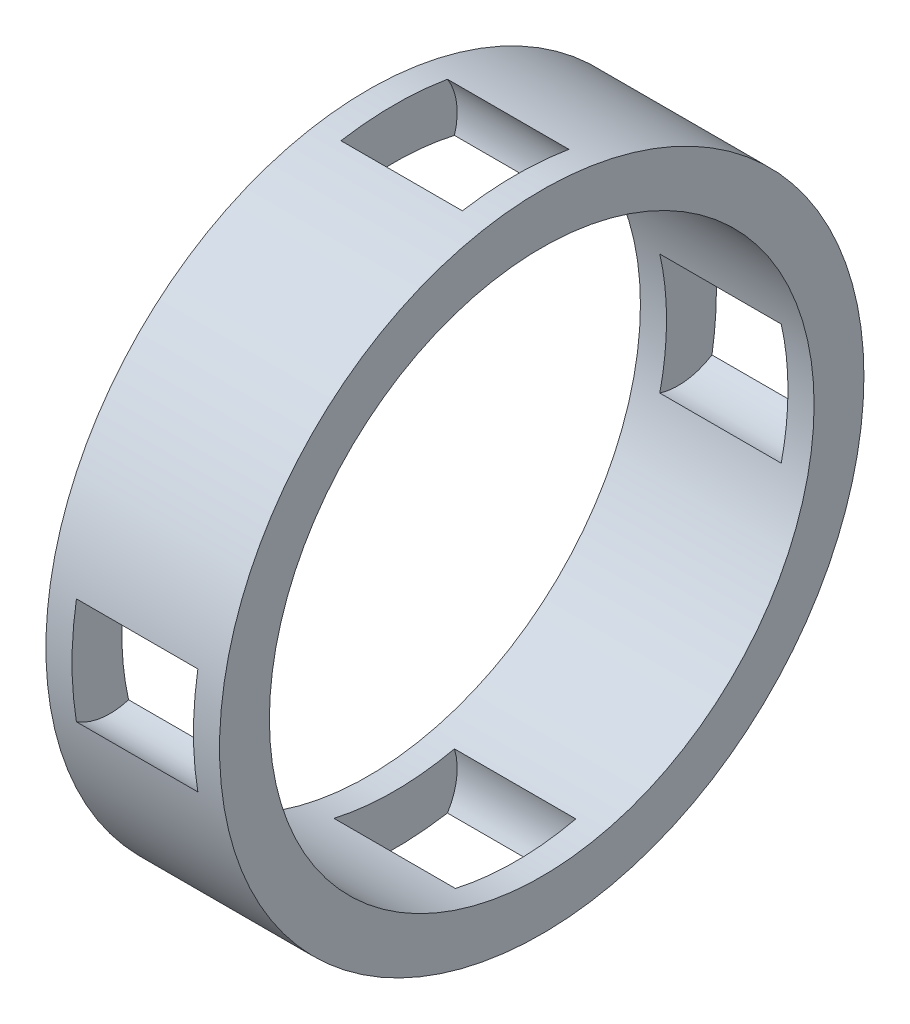
ISO-10303-21;
HEADER;
FILE_DESCRIPTION(('STEP AP214'),'2;1');
FILE_NAME('part.step','',(''),(''),'','','');
FILE_SCHEMA(('AUTOMOTIVE_DESIGN { 1 0 10303 214 1 1 1 1 }'));
ENDSEC;
DATA;
#1=APPLICATION_CONTEXT('core data for automotive mechanical design processes');
#2=APPLICATION_PROTOCOL_DEFINITION('international standard','automotive_design',2000,#1);
#3=PRODUCT_CONTEXT('',#1,'mechanical');
#4=PRODUCT('Part','Part','',(#3));
#5=PRODUCT_RELATED_PRODUCT_CATEGORY('part','',(#4));
#6=PRODUCT_DEFINITION_FORMATION('','',#4);
#7=PRODUCT_DEFINITION_CONTEXT('part definition',#1,'design');
#8=PRODUCT_DEFINITION('design','',#6,#7);
#9=PRODUCT_DEFINITION_SHAPE('','',#8);
#10=(LENGTH_UNIT() NAMED_UNIT(*) SI_UNIT(.MILLI.,.METRE.));
#11=(NAMED_UNIT(*) PLANE_ANGLE_UNIT() SI_UNIT($,.RADIAN.));
#12=(NAMED_UNIT(*) SI_UNIT($,.STERADIAN.) SOLID_ANGLE_UNIT());
#13=UNCERTAINTY_MEASURE_WITH_UNIT(LENGTH_MEASURE(1.E-05),#10,'distance_accuracy_value','');
#14=(GEOMETRIC_REPRESENTATION_CONTEXT(3) GLOBAL_UNCERTAINTY_ASSIGNED_CONTEXT((#13)) GLOBAL_UNIT_ASSIGNED_CONTEXT((#10,
#11,#12)) REPRESENTATION_CONTEXT('',''));
#15=CARTESIAN_POINT('',(0.,0.,0.));
#16=DIRECTION('',(0.,0.,1.));
#17=DIRECTION('',(1.,0.,0.));
#18=AXIS2_PLACEMENT_3D('',#15,#16,#17);
#19=CARTESIAN_POINT('',(2.85,12.4,0.));
#20=DIRECTION('',(-1.,0.,0.));
#21=DIRECTION('',(0.,0.,1.));
#22=AXIS2_PLACEMENT_3D('',#19,#20,#21);
#23=PLANE('',#22);
#24=CARTESIAN_POINT('',(2.85,12.4,0.));
#25=DIRECTION('',(1.,0.,0.));
#26=DIRECTION('',(0.,0.,-1.));
#27=AXIS2_PLACEMENT_3D('',#24,#25,#26);
#28=CIRCLE('',#27,2.75);
#29=CARTESIAN_POINT('',(2.85,11.5931514616935,-2.6289723156079));
#30=VERTEX_POINT('',#29);
#31=CARTESIAN_POINT('',(2.85,13.8690083165323,-2.32476118471534));
#32=VERTEX_POINT('',#31);
#33=EDGE_CURVE('E19',#30,#32,#28,.T.);
#34=ORIENTED_EDGE('',*,*,#33,.T.);
#35=CARTESIAN_POINT('',(2.85,0.,0.));
#36=DIRECTION('',(1.,0.,0.));
#37=DIRECTION('',(0.,0.,-1.));
#38=AXIS2_PLACEMENT_3D('',#35,#36,#37);
#39=CIRCLE('',#38,14.0625);
#40=CARTESIAN_POINT('',(2.85,13.8690083165323,2.32476118471534));
#41=VERTEX_POINT('',#40);
#42=EDGE_CURVE('E160',#41,#32,#39,.F.);
#43=ORIENTED_EDGE('',*,*,#42,.F.);
#44=CARTESIAN_POINT('',(2.85,12.4,0.));
#45=DIRECTION('',(1.,0.,0.));
#46=DIRECTION('',(0.,0.,-1.));
#47=AXIS2_PLACEMENT_3D('',#44,#45,#46);
#48=CIRCLE('',#47,2.75);
#49=CARTESIAN_POINT('',(2.85,11.5931514616935,2.62897231560789));
#50=VERTEX_POINT('',#49);
#51=EDGE_CURVE('E129',#41,#50,#48,.T.);
#52=ORIENTED_EDGE('',*,*,#51,.T.);
#53=CARTESIAN_POINT('',(2.85,0.,0.));
#54=DIRECTION('',(1.,0.,0.));
#55=DIRECTION('',(0.,0.,-1.));
#56=AXIS2_PLACEMENT_3D('',#53,#54,#55);
#57=CIRCLE('',#56,11.8875);
#58=EDGE_CURVE('E125',#50,#30,#57,.F.);
#59=ORIENTED_EDGE('',*,*,#58,.T.);
#60=EDGE_LOOP('',(#34,#43,#52,#59));
#61=FACE_BOUND('',#60,.T.);
#62=ADVANCED_FACE('F16',(#61),#23,.F.);
#63=CARTESIAN_POINT('',(5.5,12.4,0.));
#64=DIRECTION('',(1.,0.,0.));
#65=DIRECTION('',(0.,0.,-1.));
#66=AXIS2_PLACEMENT_3D('',#63,#64,#65);
#67=CYLINDRICAL_SURFACE('',#66,2.75);
#68=CARTESIAN_POINT('',(8.15,12.4,0.));
#69=DIRECTION('',(1.,0.,0.));
#70=DIRECTION('',(0.,0.,-1.));
#71=AXIS2_PLACEMENT_3D('',#68,#69,#70);
#72=CIRCLE('',#71,2.75);
#73=CARTESIAN_POINT('',(8.15,11.5931514616935,-2.62897231560789));
#74=VERTEX_POINT('',#73);
#75=CARTESIAN_POINT('',(8.15,13.8690083165323,-2.32476118471534));
#76=VERTEX_POINT('',#75);
#77=EDGE_CURVE('E143',#74,#76,#72,.T.);
#78=ORIENTED_EDGE('',*,*,#77,.T.);
#79=DIRECTION('',(1.,0.,0.));
#80=VECTOR('',#79,1.);
#81=CARTESIAN_POINT('',(5.5,13.8690083165323,-2.32476118471534));
#82=LINE('',#81,#80);
#83=EDGE_CURVE('E141',#32,#76,#82,.T.);
#84=ORIENTED_EDGE('',*,*,#83,.F.);
#85=ORIENTED_EDGE('',*,*,#33,.F.);
#86=DIRECTION('',(1.,0.,0.));
#87=VECTOR('',#86,1.);
#88=CARTESIAN_POINT('',(5.5,11.5931514616935,-2.62897231560789));
#89=LINE('',#88,#87);
#90=EDGE_CURVE('E134',#30,#74,#89,.T.);
#91=ORIENTED_EDGE('',*,*,#90,.T.);
#92=EDGE_LOOP('',(#78,#84,#85,#91));
#93=FACE_BOUND('',#92,.T.);
#94=ADVANCED_FACE('F138',(#93),#67,.F.);
#95=CARTESIAN_POINT('',(8.15,12.4,0.));
#96=DIRECTION('',(1.,0.,0.));
#97=DIRECTION('',(0.,1.,0.));
#98=AXIS2_PLACEMENT_3D('',#95,#96,#97);
#99=PLANE('',#98);
#100=CARTESIAN_POINT('',(8.15,12.4,0.));
#101=DIRECTION('',(1.,0.,0.));
#102=DIRECTION('',(0.,0.,-1.));
#103=AXIS2_PLACEMENT_3D('',#100,#101,#102);
#104=CIRCLE('',#103,2.75);
#105=CARTESIAN_POINT('',(8.15,11.5931514616935,2.6289723156079));
#106=VERTEX_POINT('',#105);
#107=CARTESIAN_POINT('',(8.15,13.8690083165323,2.32476118471534));
#108=VERTEX_POINT('',#107);
#109=EDGE_CURVE('E241',#106,#108,#104,.F.);
#110=ORIENTED_EDGE('',*,*,#109,.T.);
#111=CARTESIAN_POINT('',(8.15,0.,0.));
#112=DIRECTION('',(1.,0.,0.));
#113=DIRECTION('',(0.,0.,-1.));
#114=AXIS2_PLACEMENT_3D('',#111,#112,#113);
#115=CIRCLE('',#114,14.0625);
#116=EDGE_CURVE('E161',#76,#108,#115,.T.);
#117=ORIENTED_EDGE('',*,*,#116,.F.);
#118=ORIENTED_EDGE('',*,*,#77,.F.);
#119=CARTESIAN_POINT('',(8.15,0.,0.));
#120=DIRECTION('',(1.,0.,0.));
#121=DIRECTION('',(0.,0.,-1.));
#122=AXIS2_PLACEMENT_3D('',#119,#120,#121);
#123=CIRCLE('',#122,11.8875);
#124=EDGE_CURVE('E147',#74,#106,#123,.T.);
#125=ORIENTED_EDGE('',*,*,#124,.T.);
#126=EDGE_LOOP('',(#110,#117,#118,#125));
#127=FACE_BOUND('',#126,.T.);
#128=ADVANCED_FACE('F244',(#127),#99,.F.);
#129=CARTESIAN_POINT('',(5.5,12.4,0.));
#130=DIRECTION('',(1.,0.,0.));
#131=DIRECTION('',(0.,0.,-1.));
#132=AXIS2_PLACEMENT_3D('',#129,#130,#131);
#133=CYLINDRICAL_SURFACE('',#132,2.75);
#134=ORIENTED_EDGE('',*,*,#51,.F.);
#135=DIRECTION('',(1.,0.,0.));
#136=VECTOR('',#135,1.);
#137=CARTESIAN_POINT('',(5.5,13.8690083165323,2.32476118471534));
#138=LINE('',#137,#136);
#139=EDGE_CURVE('E157',#108,#41,#138,.F.);
#140=ORIENTED_EDGE('',*,*,#139,.F.);
#141=ORIENTED_EDGE('',*,*,#109,.F.);
#142=DIRECTION('',(1.,0.,0.));
#143=VECTOR('',#142,1.);
#144=CARTESIAN_POINT('',(5.5,11.5931514616935,2.62897231560789));
#145=LINE('',#144,#143);
#146=EDGE_CURVE('E149',#106,#50,#145,.F.);
#147=ORIENTED_EDGE('',*,*,#146,.T.);
#148=EDGE_LOOP('',(#134,#140,#141,#147));
#149=FACE_BOUND('',#148,.T.);
#150=ADVANCED_FACE('F250',(#149),#133,.F.);
#151=CARTESIAN_POINT('',(5.5,0.,-12.4));
#152=DIRECTION('',(1.,0.,0.));
#153=DIRECTION('',(0.,0.,-1.));
#154=AXIS2_PLACEMENT_3D('',#151,#152,#153);
#155=CYLINDRICAL_SURFACE('',#154,2.75);
#156=CARTESIAN_POINT('',(2.85,0.,-12.4));
#157=DIRECTION('',(1.,0.,0.));
#158=DIRECTION('',(0.,0.,-1.));
#159=AXIS2_PLACEMENT_3D('',#156,#157,#158);
#160=CIRCLE('',#159,2.75);
#161=CARTESIAN_POINT('',(2.85,2.6289723156079,-11.5931514616935));
#162=VERTEX_POINT('',#161);
#163=CARTESIAN_POINT('',(2.85,2.32476118471534,-13.8690083165323));
#164=VERTEX_POINT('',#163);
#165=EDGE_CURVE('E215',#162,#164,#160,.F.);
#166=ORIENTED_EDGE('',*,*,#165,.T.);
#167=DIRECTION('',(1.,0.,0.));
#168=VECTOR('',#167,1.);
#169=CARTESIAN_POINT('',(5.5,2.32476118471534,-13.8690083165323));
#170=LINE('',#169,#168);
#171=CARTESIAN_POINT('',(8.15,2.32476118471534,-13.8690083165323));
#172=VERTEX_POINT('',#171);
#173=EDGE_CURVE('E162',#172,#164,#170,.F.);
#174=ORIENTED_EDGE('',*,*,#173,.F.);
#175=CARTESIAN_POINT('',(8.15,0.,-12.4));
#176=DIRECTION('',(1.,0.,0.));
#177=DIRECTION('',(0.,0.,-1.));
#178=AXIS2_PLACEMENT_3D('',#175,#176,#177);
#179=CIRCLE('',#178,2.75);
#180=CARTESIAN_POINT('',(8.15,2.62897231560789,-11.5931514616935));
#181=VERTEX_POINT('',#180);
#182=EDGE_CURVE('E206',#172,#181,#179,.T.);
#183=ORIENTED_EDGE('',*,*,#182,.T.);
#184=DIRECTION('',(1.,0.,0.));
#185=VECTOR('',#184,1.);
#186=CARTESIAN_POINT('',(5.5,2.62897231560789,-11.5931514616935));
#187=LINE('',#186,#185);
#188=EDGE_CURVE('E333',#181,#162,#187,.F.);
#189=ORIENTED_EDGE('',*,*,#188,.T.);
#190=EDGE_LOOP('',(#166,#174,#183,#189));
#191=FACE_BOUND('',#190,.T.);
#192=ADVANCED_FACE('F252',(#191),#155,.F.);
#193=CARTESIAN_POINT('',(5.5,0.,12.4));
#194=DIRECTION('',(1.,0.,0.));
#195=DIRECTION('',(0.,0.,-1.));
#196=AXIS2_PLACEMENT_3D('',#193,#194,#195);
#197=CYLINDRICAL_SURFACE('',#196,2.75);
#198=CARTESIAN_POINT('',(8.15,0.,12.4));
#199=DIRECTION('',(1.,0.,0.));
#200=DIRECTION('',(0.,0.,-1.));
#201=AXIS2_PLACEMENT_3D('',#198,#199,#200);
#202=CIRCLE('',#201,2.75);
#203=CARTESIAN_POINT('',(8.15,2.6289723156079,11.5931514616935));
#204=VERTEX_POINT('',#203);
#205=CARTESIAN_POINT('',(8.15,2.32476118471534,13.8690083165323));
#206=VERTEX_POINT('',#205);
#207=EDGE_CURVE('E198',#204,#206,#202,.T.);
#208=ORIENTED_EDGE('',*,*,#207,.T.);
#209=DIRECTION('',(1.,0.,0.));
#210=VECTOR('',#209,1.);
#211=CARTESIAN_POINT('',(5.5,2.32476118471534,13.8690083165323));
#212=LINE('',#211,#210);
#213=CARTESIAN_POINT('',(2.85,2.32476118471534,13.8690083165323));
#214=VERTEX_POINT('',#213);
#215=EDGE_CURVE('E237',#214,#206,#212,.T.);
#216=ORIENTED_EDGE('',*,*,#215,.F.);
#217=CARTESIAN_POINT('',(2.85,0.,12.4));
#218=DIRECTION('',(1.,0.,0.));
#219=DIRECTION('',(0.,0.,-1.));
#220=AXIS2_PLACEMENT_3D('',#217,#218,#219);
#221=CIRCLE('',#220,2.75);
#222=CARTESIAN_POINT('',(2.85,2.6289723156079,11.5931514616935));
#223=VERTEX_POINT('',#222);
#224=EDGE_CURVE('E189',#214,#223,#221,.F.);
#225=ORIENTED_EDGE('',*,*,#224,.T.);
#226=DIRECTION('',(1.,0.,0.));
#227=VECTOR('',#226,1.);
#228=CARTESIAN_POINT('',(5.5,2.6289723156079,11.5931514616935));
#229=LINE('',#228,#227);
#230=EDGE_CURVE('E135',#223,#204,#229,.T.);
#231=ORIENTED_EDGE('',*,*,#230,.T.);
#232=EDGE_LOOP('',(#208,#216,#225,#231));
#233=FACE_BOUND('',#232,.T.);
#234=ADVANCED_FACE('F259',(#233),#197,.F.);
#235=CARTESIAN_POINT('',(5.5,0.,0.));
#236=DIRECTION('',(1.,0.,0.));
#237=DIRECTION('',(0.,0.,-1.));
#238=AXIS2_PLACEMENT_3D('',#235,#236,#237);
#239=CYLINDRICAL_SURFACE('',#238,11.8875);
#240=CARTESIAN_POINT('',(8.14999999999999,0.,0.));
#241=DIRECTION('',(1.,0.,0.));
#242=DIRECTION('',(0.,0.,-1.));
#243=AXIS2_PLACEMENT_3D('',#240,#241,#242);
#244=CIRCLE('',#243,11.8875);
#245=CARTESIAN_POINT('',(8.15,-2.6289723156079,-11.5931514616935));
#246=VERTEX_POINT('',#245);
#247=EDGE_CURVE('E204',#181,#246,#244,.F.);
#248=ORIENTED_EDGE('',*,*,#247,.T.);
#249=DIRECTION('',(1.,0.,0.));
#250=VECTOR('',#249,1.);
#251=CARTESIAN_POINT('',(5.5,-2.62897231560789,-11.5931514616935));
#252=LINE('',#251,#250);
#253=CARTESIAN_POINT('',(2.85,-2.6289723156079,-11.5931514616935));
#254=VERTEX_POINT('',#253);
#255=EDGE_CURVE('E210',#246,#254,#252,.F.);
#256=ORIENTED_EDGE('',*,*,#255,.T.);
#257=CARTESIAN_POINT('',(2.84999999999999,0.,0.));
#258=DIRECTION('',(1.,0.,0.));
#259=DIRECTION('',(0.,0.,-1.));
#260=AXIS2_PLACEMENT_3D('',#257,#258,#259);
#261=CIRCLE('',#260,11.8875);
#262=EDGE_CURVE('E213',#254,#162,#261,.T.);
#263=ORIENTED_EDGE('',*,*,#262,.T.);
#264=ORIENTED_EDGE('',*,*,#188,.F.);
#265=EDGE_LOOP('',(#248,#256,#263,#264));
#266=FACE_BOUND('',#265,.T.);
#267=CARTESIAN_POINT('',(1.71,0.,0.));
#268=DIRECTION('',(1.,0.,0.));
#269=DIRECTION('',(0.,0.,-1.));
#270=AXIS2_PLACEMENT_3D('',#267,#268,#269);
#271=CIRCLE('',#270,11.8875);
#272=CARTESIAN_POINT('',(1.71,0.,-11.8875));
#273=VERTEX_POINT('',#272);
#274=EDGE_CURVE('E218',#273,#273,#271,.T.);
#275=ORIENTED_EDGE('',*,*,#274,.F.);
#276=EDGE_LOOP('',(#275));
#277=FACE_BOUND('',#276,.T.);
#278=CARTESIAN_POINT('',(2.85,0.,0.));
#279=DIRECTION('',(1.,0.,0.));
#280=DIRECTION('',(0.,0.,-1.));
#281=AXIS2_PLACEMENT_3D('',#278,#279,#280);
#282=CIRCLE('',#281,11.8875);
#283=CARTESIAN_POINT('',(2.85,-2.6289723156079,11.5931514616935));
#284=VERTEX_POINT('',#283);
#285=EDGE_CURVE('E187',#223,#284,#282,.T.);
#286=ORIENTED_EDGE('',*,*,#285,.T.);
#287=DIRECTION('',(1.,0.,0.));
#288=VECTOR('',#287,1.);
#289=CARTESIAN_POINT('',(5.5,-2.6289723156079,11.5931514616935));
#290=LINE('',#289,#288);
#291=CARTESIAN_POINT('',(8.15,-2.6289723156079,11.5931514616935));
#292=VERTEX_POINT('',#291);
#293=EDGE_CURVE('E193',#284,#292,#290,.T.);
#294=ORIENTED_EDGE('',*,*,#293,.T.);
#295=CARTESIAN_POINT('',(8.15,0.,0.));
#296=DIRECTION('',(1.,0.,0.));
#297=DIRECTION('',(0.,0.,-1.));
#298=AXIS2_PLACEMENT_3D('',#295,#296,#297);
#299=CIRCLE('',#298,11.8875);
#300=EDGE_CURVE('E196',#292,#204,#299,.F.);
#301=ORIENTED_EDGE('',*,*,#300,.T.);
#302=ORIENTED_EDGE('',*,*,#230,.F.);
#303=EDGE_LOOP('',(#286,#294,#301,#302));
#304=FACE_BOUND('',#303,.T.);
#305=ORIENTED_EDGE('',*,*,#124,.F.);
#306=ORIENTED_EDGE('',*,*,#90,.F.);
#307=ORIENTED_EDGE('',*,*,#58,.F.);
#308=ORIENTED_EDGE('',*,*,#146,.F.);
#309=EDGE_LOOP('',(#305,#306,#307,#308));
#310=FACE_BOUND('',#309,.T.);
#311=CARTESIAN_POINT('',(9.29,0.,0.));
#312=DIRECTION('',(1.,0.,0.));
#313=DIRECTION('',(0.,0.,-1.));
#314=AXIS2_PLACEMENT_3D('',#311,#312,#313);
#315=CIRCLE('',#314,11.8875);
#316=CARTESIAN_POINT('',(9.29,0.,-11.8875));
#317=VERTEX_POINT('',#316);
#318=EDGE_CURVE('E201',#317,#317,#315,.F.);
#319=ORIENTED_EDGE('',*,*,#318,.F.);
#320=EDGE_LOOP('',(#319));
#321=FACE_BOUND('',#320,.T.);
#322=CARTESIAN_POINT('',(8.15,0.,0.));
#323=DIRECTION('',(1.,0.,0.));
#324=DIRECTION('',(0.,0.,-1.));
#325=AXIS2_PLACEMENT_3D('',#322,#323,#324);
#326=CIRCLE('',#325,11.8875);
#327=CARTESIAN_POINT('',(8.15,-11.5931514616935,-2.62897231560789));
#328=VERTEX_POINT('',#327);
#329=CARTESIAN_POINT('',(8.15,-11.5931514616935,2.6289723156079));
#330=VERTEX_POINT('',#329);
#331=EDGE_CURVE('E231',#328,#330,#326,.F.);
#332=ORIENTED_EDGE('',*,*,#331,.T.);
#333=DIRECTION('',(1.,0.,0.));
#334=VECTOR('',#333,1.);
#335=CARTESIAN_POINT('',(5.5,-11.5931514616935,2.6289723156079));
#336=LINE('',#335,#334);
#337=CARTESIAN_POINT('',(2.85,-11.5931514616935,2.6289723156079));
#338=VERTEX_POINT('',#337);
#339=EDGE_CURVE('E156',#330,#338,#336,.F.);
#340=ORIENTED_EDGE('',*,*,#339,.T.);
#341=CARTESIAN_POINT('',(2.85,0.,0.));
#342=DIRECTION('',(1.,0.,0.));
#343=DIRECTION('',(0.,0.,-1.));
#344=AXIS2_PLACEMENT_3D('',#341,#342,#343);
#345=CIRCLE('',#344,11.8875);
#346=CARTESIAN_POINT('',(2.85,-11.5931514616935,-2.6289723156079));
#347=VERTEX_POINT('',#346);
#348=EDGE_CURVE('E221',#338,#347,#345,.T.);
#349=ORIENTED_EDGE('',*,*,#348,.T.);
#350=DIRECTION('',(1.,0.,0.));
#351=VECTOR('',#350,1.);
#352=CARTESIAN_POINT('',(5.5,-11.5931514616935,-2.62897231560789));
#353=LINE('',#352,#351);
#354=EDGE_CURVE('E153',#347,#328,#353,.T.);
#355=ORIENTED_EDGE('',*,*,#354,.T.);
#356=EDGE_LOOP('',(#332,#340,#349,#355));
#357=FACE_BOUND('',#356,.T.);
#358=ADVANCED_FACE('F145',(#266,#277,#304,#310,#321,#357),#239,.F.);
#359=CARTESIAN_POINT('',(5.5,-12.4,0.));
#360=DIRECTION('',(1.,0.,0.));
#361=DIRECTION('',(0.,0.,-1.));
#362=AXIS2_PLACEMENT_3D('',#359,#360,#361);
#363=CYLINDRICAL_SURFACE('',#362,2.75);
#364=CARTESIAN_POINT('',(8.15,-12.4,0.));
#365=DIRECTION('',(1.,0.,0.));
#366=DIRECTION('',(0.,0.,-1.));
#367=AXIS2_PLACEMENT_3D('',#364,#365,#366);
#368=CIRCLE('',#367,2.75);
#369=CARTESIAN_POINT('',(8.15,-13.8690083165323,2.32476118471534));
#370=VERTEX_POINT('',#369);
#371=EDGE_CURVE('E234',#330,#370,#368,.T.);
#372=ORIENTED_EDGE('',*,*,#371,.T.);
#373=DIRECTION('',(1.,0.,0.));
#374=VECTOR('',#373,1.);
#375=CARTESIAN_POINT('',(5.5,-13.8690083165323,2.32476118471534));
#376=LINE('',#375,#374);
#377=CARTESIAN_POINT('',(2.85,-13.8690083165323,2.32476118471534));
#378=VERTEX_POINT('',#377);
#379=EDGE_CURVE('E186',#378,#370,#376,.T.);
#380=ORIENTED_EDGE('',*,*,#379,.F.);
#381=CARTESIAN_POINT('',(2.85,-12.4,0.));
#382=DIRECTION('',(1.,0.,0.));
#383=DIRECTION('',(0.,0.,-1.));
#384=AXIS2_PLACEMENT_3D('',#381,#382,#383);
#385=CIRCLE('',#384,2.75);
#386=EDGE_CURVE('E224',#378,#338,#385,.F.);
#387=ORIENTED_EDGE('',*,*,#386,.T.);
#388=ORIENTED_EDGE('',*,*,#339,.F.);
#389=EDGE_LOOP('',(#372,#380,#387,#388));
#390=FACE_BOUND('',#389,.T.);
#391=ADVANCED_FACE('F312',(#390),#363,.F.);
#392=CARTESIAN_POINT('',(8.15,-12.4,0.));
#393=DIRECTION('',(1.,0.,0.));
#394=DIRECTION('',(0.,1.,0.));
#395=AXIS2_PLACEMENT_3D('',#392,#393,#394);
#396=PLANE('',#395);
#397=CARTESIAN_POINT('',(8.15,-12.4,0.));
#398=DIRECTION('',(1.,0.,0.));
#399=DIRECTION('',(0.,0.,-1.));
#400=AXIS2_PLACEMENT_3D('',#397,#398,#399);
#401=CIRCLE('',#400,2.75);
#402=CARTESIAN_POINT('',(8.15,-13.8690083165323,-2.32476118471534));
#403=VERTEX_POINT('',#402);
#404=EDGE_CURVE('E229',#328,#403,#401,.F.);
#405=ORIENTED_EDGE('',*,*,#404,.T.);
#406=CARTESIAN_POINT('',(8.15,0.,0.));
#407=DIRECTION('',(1.,0.,0.));
#408=DIRECTION('',(0.,0.,-1.));
#409=AXIS2_PLACEMENT_3D('',#406,#407,#408);
#410=CIRCLE('',#409,14.0625);
#411=EDGE_CURVE('E183',#370,#403,#410,.T.);
#412=ORIENTED_EDGE('',*,*,#411,.F.);
#413=ORIENTED_EDGE('',*,*,#371,.F.);
#414=ORIENTED_EDGE('',*,*,#331,.F.);
#415=EDGE_LOOP('',(#405,#412,#413,#414));
#416=FACE_BOUND('',#415,.T.);
#417=ADVANCED_FACE('F308',(#416),#396,.F.);
#418=CARTESIAN_POINT('',(5.5,-12.4,0.));
#419=DIRECTION('',(1.,0.,0.));
#420=DIRECTION('',(0.,0.,-1.));
#421=AXIS2_PLACEMENT_3D('',#418,#419,#420);
#422=CYLINDRICAL_SURFACE('',#421,2.75);
#423=CARTESIAN_POINT('',(2.85,-12.4,0.));
#424=DIRECTION('',(1.,0.,0.));
#425=DIRECTION('',(0.,0.,-1.));
#426=AXIS2_PLACEMENT_3D('',#423,#424,#425);
#427=CIRCLE('',#426,2.75);
#428=CARTESIAN_POINT('',(2.85,-13.8690083165323,-2.32476118471534));
#429=VERTEX_POINT('',#428);
#430=EDGE_CURVE('E227',#347,#429,#427,.F.);
#431=ORIENTED_EDGE('',*,*,#430,.T.);
#432=DIRECTION('',(1.,0.,0.));
#433=VECTOR('',#432,1.);
#434=CARTESIAN_POINT('',(5.5,-13.8690083165323,-2.32476118471534));
#435=LINE('',#434,#433);
#436=EDGE_CURVE('E182',#403,#429,#435,.F.);
#437=ORIENTED_EDGE('',*,*,#436,.F.);
#438=ORIENTED_EDGE('',*,*,#404,.F.);
#439=ORIENTED_EDGE('',*,*,#354,.F.);
#440=EDGE_LOOP('',(#431,#437,#438,#439));
#441=FACE_BOUND('',#440,.T.);
#442=ADVANCED_FACE('F304',(#441),#422,.F.);
#443=CARTESIAN_POINT('',(2.85,-12.4,0.));
#444=DIRECTION('',(-1.,0.,0.));
#445=DIRECTION('',(0.,0.,1.));
#446=AXIS2_PLACEMENT_3D('',#443,#444,#445);
#447=PLANE('',#446);
#448=ORIENTED_EDGE('',*,*,#386,.F.);
#449=CARTESIAN_POINT('',(2.85,0.,0.));
#450=DIRECTION('',(1.,0.,0.));
#451=DIRECTION('',(0.,0.,-1.));
#452=AXIS2_PLACEMENT_3D('',#449,#450,#451);
#453=CIRCLE('',#452,14.0625);
#454=EDGE_CURVE('E179',#429,#378,#453,.F.);
#455=ORIENTED_EDGE('',*,*,#454,.F.);
#456=ORIENTED_EDGE('',*,*,#430,.F.);
#457=ORIENTED_EDGE('',*,*,#348,.F.);
#458=EDGE_LOOP('',(#448,#455,#456,#457));
#459=FACE_BOUND('',#458,.T.);
#460=ADVANCED_FACE('F300',(#459),#447,.F.);
#461=CARTESIAN_POINT('',(1.71,0.,0.));
#462=DIRECTION('',(-1.,0.,0.));
#463=DIRECTION('',(0.,0.,1.));
#464=AXIS2_PLACEMENT_3D('',#461,#462,#463);
#465=PLANE('',#464);
#466=CARTESIAN_POINT('',(1.71,0.,0.));
#467=DIRECTION('',(1.,0.,0.));
#468=DIRECTION('',(0.,0.,-1.));
#469=AXIS2_PLACEMENT_3D('',#466,#467,#468);
#470=CIRCLE('',#469,14.0625);
#471=CARTESIAN_POINT('',(1.71,0.,-14.0625));
#472=VERTEX_POINT('',#471);
#473=EDGE_CURVE('E176',#472,#472,#470,.T.);
#474=ORIENTED_EDGE('',*,*,#473,.F.);
#475=EDGE_LOOP('',(#474));
#476=FACE_BOUND('',#475,.T.);
#477=ORIENTED_EDGE('',*,*,#274,.T.);
#478=EDGE_LOOP('',(#477));
#479=FACE_BOUND('',#478,.T.);
#480=ADVANCED_FACE('F296',(#476,#479),#465,.T.);
#481=CARTESIAN_POINT('',(2.85,0.,-12.4));
#482=DIRECTION('',(-1.,0.,0.));
#483=DIRECTION('',(0.,0.,1.));
#484=AXIS2_PLACEMENT_3D('',#481,#482,#483);
#485=PLANE('',#484);
#486=CARTESIAN_POINT('',(2.85,0.,-12.4));
#487=DIRECTION('',(1.,0.,0.));
#488=DIRECTION('',(0.,0.,-1.));
#489=AXIS2_PLACEMENT_3D('',#486,#487,#488);
#490=CIRCLE('',#489,2.75);
#491=CARTESIAN_POINT('',(2.85,-2.32476118471534,-13.8690083165323));
#492=VERTEX_POINT('',#491);
#493=EDGE_CURVE('E211',#254,#492,#490,.T.);
#494=ORIENTED_EDGE('',*,*,#493,.T.);
#495=CARTESIAN_POINT('',(2.84999999999999,0.,0.));
#496=DIRECTION('',(1.,0.,0.));
#497=DIRECTION('',(0.,0.,-1.));
#498=AXIS2_PLACEMENT_3D('',#495,#496,#497);
#499=CIRCLE('',#498,14.0625);
#500=EDGE_CURVE('E173',#164,#492,#499,.F.);
#501=ORIENTED_EDGE('',*,*,#500,.F.);
#502=ORIENTED_EDGE('',*,*,#165,.F.);
#503=ORIENTED_EDGE('',*,*,#262,.F.);
#504=EDGE_LOOP('',(#494,#501,#502,#503));
#505=FACE_BOUND('',#504,.T.);
#506=ADVANCED_FACE('F292',(#505),#485,.F.);
#507=CARTESIAN_POINT('',(5.5,0.,-12.4));
#508=DIRECTION('',(1.,0.,0.));
#509=DIRECTION('',(0.,0.,-1.));
#510=AXIS2_PLACEMENT_3D('',#507,#508,#509);
#511=CYLINDRICAL_SURFACE('',#510,2.75);
#512=CARTESIAN_POINT('',(8.15,0.,-12.4));
#513=DIRECTION('',(1.,0.,0.));
#514=DIRECTION('',(0.,0.,-1.));
#515=AXIS2_PLACEMENT_3D('',#512,#513,#514);
#516=CIRCLE('',#515,2.75);
#517=CARTESIAN_POINT('',(8.15,-2.32476118471534,-13.8690083165323));
#518=VERTEX_POINT('',#517);
#519=EDGE_CURVE('E208',#246,#518,#516,.T.);
#520=ORIENTED_EDGE('',*,*,#519,.T.);
#521=DIRECTION('',(1.,0.,0.));
#522=VECTOR('',#521,1.);
#523=CARTESIAN_POINT('',(5.5,-2.32476118471534,-13.8690083165323));
#524=LINE('',#523,#522);
#525=EDGE_CURVE('E172',#492,#518,#524,.T.);
#526=ORIENTED_EDGE('',*,*,#525,.F.);
#527=ORIENTED_EDGE('',*,*,#493,.F.);
#528=ORIENTED_EDGE('',*,*,#255,.F.);
#529=EDGE_LOOP('',(#520,#526,#527,#528));
#530=FACE_BOUND('',#529,.T.);
#531=ADVANCED_FACE('F288',(#530),#511,.F.);
#532=CARTESIAN_POINT('',(8.15,0.,-12.4));
#533=DIRECTION('',(1.,0.,0.));
#534=DIRECTION('',(0.,0.,-1.));
#535=AXIS2_PLACEMENT_3D('',#532,#533,#534);
#536=PLANE('',#535);
#537=ORIENTED_EDGE('',*,*,#182,.F.);
#538=CARTESIAN_POINT('',(8.15,0.,0.));
#539=DIRECTION('',(1.,0.,0.));
#540=DIRECTION('',(0.,0.,-1.));
#541=AXIS2_PLACEMENT_3D('',#538,#539,#540);
#542=CIRCLE('',#541,14.0625);
#543=EDGE_CURVE('E170',#518,#172,#542,.T.);
#544=ORIENTED_EDGE('',*,*,#543,.F.);
#545=ORIENTED_EDGE('',*,*,#519,.F.);
#546=ORIENTED_EDGE('',*,*,#247,.F.);
#547=EDGE_LOOP('',(#537,#544,#545,#546));
#548=FACE_BOUND('',#547,.T.);
#549=ADVANCED_FACE('F284',(#548),#536,.F.);
#550=CARTESIAN_POINT('',(9.29,0.,0.));
#551=DIRECTION('',(1.,0.,0.));
#552=DIRECTION('',(0.,1.,0.));
#553=AXIS2_PLACEMENT_3D('',#550,#551,#552);
#554=PLANE('',#553);
#555=CARTESIAN_POINT('',(9.29,0.,0.));
#556=DIRECTION('',(1.,0.,0.));
#557=DIRECTION('',(0.,0.,-1.));
#558=AXIS2_PLACEMENT_3D('',#555,#556,#557);
#559=CIRCLE('',#558,14.0625);
#560=CARTESIAN_POINT('',(9.29,0.,-14.0625));
#561=VERTEX_POINT('',#560);
#562=EDGE_CURVE('E167',#561,#561,#559,.F.);
#563=ORIENTED_EDGE('',*,*,#562,.F.);
#564=EDGE_LOOP('',(#563));
#565=FACE_BOUND('',#564,.T.);
#566=ORIENTED_EDGE('',*,*,#318,.T.);
#567=EDGE_LOOP('',(#566));
#568=FACE_BOUND('',#567,.T.);
#569=ADVANCED_FACE('F280',(#565,#568),#554,.T.);
#570=CARTESIAN_POINT('',(8.15,0.,12.4));
#571=DIRECTION('',(1.,0.,0.));
#572=DIRECTION('',(0.,1.,0.));
#573=AXIS2_PLACEMENT_3D('',#570,#571,#572);
#574=PLANE('',#573);
#575=CARTESIAN_POINT('',(8.15,0.,12.4));
#576=DIRECTION('',(1.,0.,0.));
#577=DIRECTION('',(0.,0.,-1.));
#578=AXIS2_PLACEMENT_3D('',#575,#576,#577);
#579=CIRCLE('',#578,2.75);
#580=CARTESIAN_POINT('',(8.15,-2.32476118471533,13.8690083165323));
#581=VERTEX_POINT('',#580);
#582=EDGE_CURVE('E194',#292,#581,#579,.F.);
#583=ORIENTED_EDGE('',*,*,#582,.T.);
#584=CARTESIAN_POINT('',(8.15,0.,0.));
#585=DIRECTION('',(1.,0.,0.));
#586=DIRECTION('',(0.,0.,-1.));
#587=AXIS2_PLACEMENT_3D('',#584,#585,#586);
#588=CIRCLE('',#587,14.0625);
#589=EDGE_CURVE('E164',#206,#581,#588,.T.);
#590=ORIENTED_EDGE('',*,*,#589,.F.);
#591=ORIENTED_EDGE('',*,*,#207,.F.);
#592=ORIENTED_EDGE('',*,*,#300,.F.);
#593=EDGE_LOOP('',(#583,#590,#591,#592));
#594=FACE_BOUND('',#593,.T.);
#595=ADVANCED_FACE('F277',(#594),#574,.F.);
#596=CARTESIAN_POINT('',(5.5,0.,12.4));
#597=DIRECTION('',(1.,0.,0.));
#598=DIRECTION('',(0.,0.,-1.));
#599=AXIS2_PLACEMENT_3D('',#596,#597,#598);
#600=CYLINDRICAL_SURFACE('',#599,2.75);
#601=CARTESIAN_POINT('',(2.85,0.,12.4));
#602=DIRECTION('',(1.,0.,0.));
#603=DIRECTION('',(0.,0.,-1.));
#604=AXIS2_PLACEMENT_3D('',#601,#602,#603);
#605=CIRCLE('',#604,2.75);
#606=CARTESIAN_POINT('',(2.85,-2.32476118471534,13.8690083165323));
#607=VERTEX_POINT('',#606);
#608=EDGE_CURVE('E34',#284,#607,#605,.F.);
#609=ORIENTED_EDGE('',*,*,#608,.T.);
#610=DIRECTION('',(1.,0.,0.));
#611=VECTOR('',#610,1.);
#612=CARTESIAN_POINT('',(5.5,-2.32476118471533,13.8690083165323));
#613=LINE('',#612,#611);
#614=EDGE_CURVE('E25',#581,#607,#613,.F.);
#615=ORIENTED_EDGE('',*,*,#614,.F.);
#616=ORIENTED_EDGE('',*,*,#582,.F.);
#617=ORIENTED_EDGE('',*,*,#293,.F.);
#618=EDGE_LOOP('',(#609,#615,#616,#617));
#619=FACE_BOUND('',#618,.T.);
#620=ADVANCED_FACE('F270',(#619),#600,.F.);
#621=CARTESIAN_POINT('',(2.85,0.,12.4));
#622=DIRECTION('',(-1.,0.,0.));
#623=DIRECTION('',(0.,0.,1.));
#624=AXIS2_PLACEMENT_3D('',#621,#622,#623);
#625=PLANE('',#624);
#626=ORIENTED_EDGE('',*,*,#224,.F.);
#627=CARTESIAN_POINT('',(2.85,0.,0.));
#628=DIRECTION('',(1.,0.,0.));
#629=DIRECTION('',(0.,0.,-1.));
#630=AXIS2_PLACEMENT_3D('',#627,#628,#629);
#631=CIRCLE('',#630,14.0625);
#632=EDGE_CURVE('E11',#607,#214,#631,.F.);
#633=ORIENTED_EDGE('',*,*,#632,.F.);
#634=ORIENTED_EDGE('',*,*,#608,.F.);
#635=ORIENTED_EDGE('',*,*,#285,.F.);
#636=EDGE_LOOP('',(#626,#633,#634,#635));
#637=FACE_BOUND('',#636,.T.);
#638=ADVANCED_FACE('F264',(#637),#625,.F.);
#639=CARTESIAN_POINT('',(5.5,0.,0.));
#640=DIRECTION('',(1.,0.,0.));
#641=DIRECTION('',(0.,0.,-1.));
#642=AXIS2_PLACEMENT_3D('',#639,#640,#641);
#643=CYLINDRICAL_SURFACE('',#642,14.0625);
#644=ORIENTED_EDGE('',*,*,#632,.T.);
#645=ORIENTED_EDGE('',*,*,#215,.T.);
#646=ORIENTED_EDGE('',*,*,#589,.T.);
#647=ORIENTED_EDGE('',*,*,#614,.T.);
#648=EDGE_LOOP('',(#644,#645,#646,#647));
#649=FACE_BOUND('',#648,.T.);
#650=ORIENTED_EDGE('',*,*,#562,.T.);
#651=EDGE_LOOP('',(#650));
#652=FACE_BOUND('',#651,.T.);
#653=ORIENTED_EDGE('',*,*,#543,.T.);
#654=ORIENTED_EDGE('',*,*,#173,.T.);
#655=ORIENTED_EDGE('',*,*,#500,.T.);
#656=ORIENTED_EDGE('',*,*,#525,.T.);
#657=EDGE_LOOP('',(#653,#654,#655,#656));
#658=FACE_BOUND('',#657,.T.);
#659=ORIENTED_EDGE('',*,*,#473,.T.);
#660=EDGE_LOOP('',(#659));
#661=FACE_BOUND('',#660,.T.);
#662=ORIENTED_EDGE('',*,*,#436,.T.);
#663=ORIENTED_EDGE('',*,*,#454,.T.);
#664=ORIENTED_EDGE('',*,*,#379,.T.);
#665=ORIENTED_EDGE('',*,*,#411,.T.);
#666=EDGE_LOOP('',(#662,#663,#664,#665));
#667=FACE_BOUND('',#666,.T.);
#668=ORIENTED_EDGE('',*,*,#139,.T.);
#669=ORIENTED_EDGE('',*,*,#42,.T.);
#670=ORIENTED_EDGE('',*,*,#83,.T.);
#671=ORIENTED_EDGE('',*,*,#116,.T.);
#672=EDGE_LOOP('',(#668,#669,#670,#671));
#673=FACE_BOUND('',#672,.T.);
#674=ADVANCED_FACE('F248',(#649,#652,#658,#661,#667,#673),#643,.T.);
#675=CLOSED_SHELL('',(#62,#94,#128,#150,#192,#234,#358,#391,#417,#442,#460,#480,#506,#531,#549,
#569,#595,#620,#638,#674));
#676=MANIFOLD_SOLID_BREP('B1',#675);
#677=ADVANCED_BREP_SHAPE_REPRESENTATION('',(#18,#676),#14);
#678=SHAPE_DEFINITION_REPRESENTATION(#9,#677);
ENDSEC;
END-ISO-10303-21;
